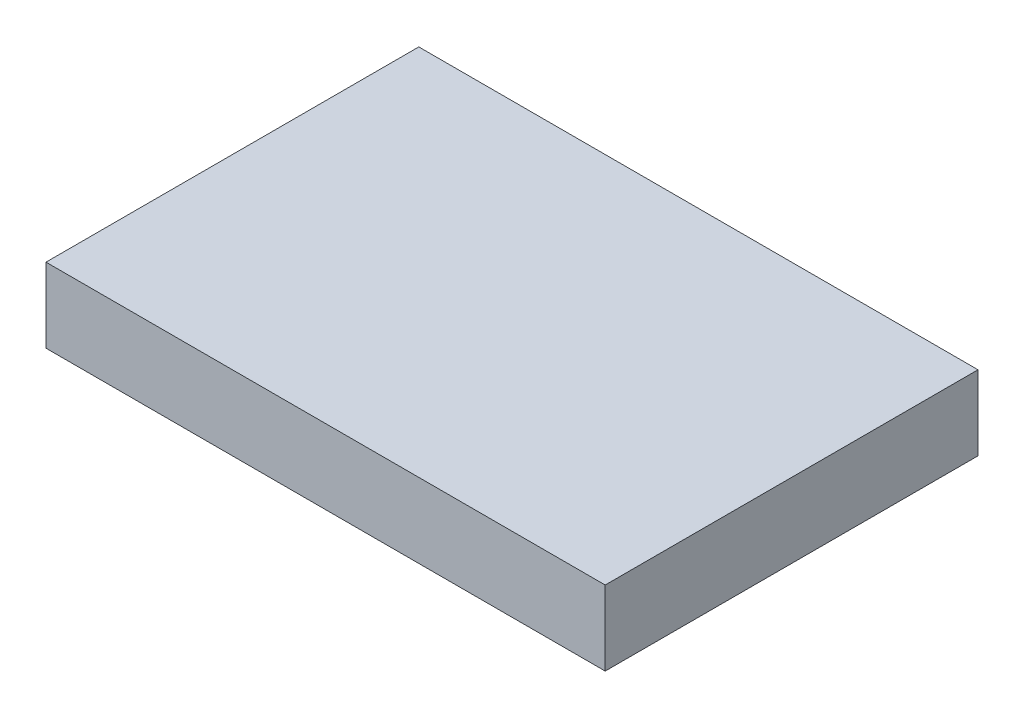
ISO-10303-21;
HEADER;
FILE_DESCRIPTION(('STEP AP214'),'2;1');
FILE_NAME('part.step','',(''),(''),'','','');
FILE_SCHEMA(('AUTOMOTIVE_DESIGN { 1 0 10303 214 1 1 1 1 }'));
ENDSEC;
DATA;
#1=APPLICATION_CONTEXT('core data for automotive mechanical design processes');
#2=APPLICATION_PROTOCOL_DEFINITION('international standard','automotive_design',2000,#1);
#3=PRODUCT_CONTEXT('',#1,'mechanical');
#4=PRODUCT('Part','Part','',(#3));
#5=PRODUCT_RELATED_PRODUCT_CATEGORY('part','',(#4));
#6=PRODUCT_DEFINITION_FORMATION('','',#4);
#7=PRODUCT_DEFINITION_CONTEXT('part definition',#1,'design');
#8=PRODUCT_DEFINITION('design','',#6,#7);
#9=PRODUCT_DEFINITION_SHAPE('','',#8);
#10=(LENGTH_UNIT() NAMED_UNIT(*) SI_UNIT(.MILLI.,.METRE.));
#11=(NAMED_UNIT(*) PLANE_ANGLE_UNIT() SI_UNIT($,.RADIAN.));
#12=(NAMED_UNIT(*) SI_UNIT($,.STERADIAN.) SOLID_ANGLE_UNIT());
#13=UNCERTAINTY_MEASURE_WITH_UNIT(LENGTH_MEASURE(1.E-05),#10,'distance_accuracy_value','');
#14=(GEOMETRIC_REPRESENTATION_CONTEXT(3) GLOBAL_UNCERTAINTY_ASSIGNED_CONTEXT((#13)) GLOBAL_UNIT_ASSIGNED_CONTEXT((#10,
#11,#12)) REPRESENTATION_CONTEXT('',''));
#15=CARTESIAN_POINT('',(0.,0.,0.));
#16=DIRECTION('',(0.,0.,1.));
#17=DIRECTION('',(1.,0.,0.));
#18=AXIS2_PLACEMENT_3D('',#15,#16,#17);
#19=CARTESIAN_POINT('',(45720.,12192.,30480.));
#20=DIRECTION('',(-1.,0.,0.));
#21=DIRECTION('',(0.,0.,1.));
#22=AXIS2_PLACEMENT_3D('',#19,#20,#21);
#23=PLANE('',#22);
#24=DIRECTION('',(0.,0.,-1.));
#25=VECTOR('',#24,1.);
#26=CARTESIAN_POINT('',(45720.,0.,30480.));
#27=LINE('',#26,#25);
#28=CARTESIAN_POINT('',(45720.,0.,30480.));
#29=VERTEX_POINT('',#28);
#30=CARTESIAN_POINT('',(45720.,0.,-30480.));
#31=VERTEX_POINT('',#30);
#32=EDGE_CURVE('E98',#29,#31,#27,.T.);
#33=ORIENTED_EDGE('',*,*,#32,.T.);
#34=DIRECTION('',(0.,-1.,0.));
#35=VECTOR('',#34,1.);
#36=CARTESIAN_POINT('',(45720.,12192.,-30480.));
#37=LINE('',#36,#35);
#38=CARTESIAN_POINT('',(45720.,12192.,-30480.));
#39=VERTEX_POINT('',#38);
#40=EDGE_CURVE('E11',#39,#31,#37,.T.);
#41=ORIENTED_EDGE('',*,*,#40,.F.);
#42=DIRECTION('',(0.,0.,-1.));
#43=VECTOR('',#42,1.);
#44=CARTESIAN_POINT('',(45720.,12192.,30480.));
#45=LINE('',#44,#43);
#46=CARTESIAN_POINT('',(45720.,12192.,30480.));
#47=VERTEX_POINT('',#46);
#48=EDGE_CURVE('E86',#47,#39,#45,.T.);
#49=ORIENTED_EDGE('',*,*,#48,.F.);
#50=DIRECTION('',(0.,-1.,0.));
#51=VECTOR('',#50,1.);
#52=CARTESIAN_POINT('',(45720.,12192.,30480.));
#53=LINE('',#52,#51);
#54=EDGE_CURVE('E94',#47,#29,#53,.T.);
#55=ORIENTED_EDGE('',*,*,#54,.T.);
#56=EDGE_LOOP('',(#33,#41,#49,#55));
#57=FACE_BOUND('',#56,.T.);
#58=ADVANCED_FACE('F35',(#57),#23,.F.);
#59=CARTESIAN_POINT('',(-45720.,12192.,-30480.));
#60=DIRECTION('',(0.,0.,1.));
#61=DIRECTION('',(1.,0.,0.));
#62=AXIS2_PLACEMENT_3D('',#59,#60,#61);
#63=PLANE('',#62);
#64=DIRECTION('',(-1.,0.,0.));
#65=VECTOR('',#64,1.);
#66=CARTESIAN_POINT('',(-45720.,0.,-30480.));
#67=LINE('',#66,#65);
#68=CARTESIAN_POINT('',(-45720.,0.,-30480.));
#69=VERTEX_POINT('',#68);
#70=EDGE_CURVE('E90',#31,#69,#67,.T.);
#71=ORIENTED_EDGE('',*,*,#70,.T.);
#72=DIRECTION('',(0.,-1.,0.));
#73=VECTOR('',#72,1.);
#74=CARTESIAN_POINT('',(-45720.,12192.,-30480.));
#75=LINE('',#74,#73);
#76=CARTESIAN_POINT('',(-45720.,12192.,-30480.));
#77=VERTEX_POINT('',#76);
#78=EDGE_CURVE('E43',#77,#69,#75,.T.);
#79=ORIENTED_EDGE('',*,*,#78,.F.);
#80=DIRECTION('',(-1.,0.,0.));
#81=VECTOR('',#80,1.);
#82=CARTESIAN_POINT('',(-45720.,12192.,-30480.));
#83=LINE('',#82,#81);
#84=EDGE_CURVE('E81',#39,#77,#83,.T.);
#85=ORIENTED_EDGE('',*,*,#84,.F.);
#86=ORIENTED_EDGE('',*,*,#40,.T.);
#87=EDGE_LOOP('',(#71,#79,#85,#86));
#88=FACE_BOUND('',#87,.T.);
#89=ADVANCED_FACE('F89',(#88),#63,.F.);
#90=CARTESIAN_POINT('',(-45720.,12192.,30480.));
#91=DIRECTION('',(1.,0.,0.));
#92=DIRECTION('',(0.,0.,-1.));
#93=AXIS2_PLACEMENT_3D('',#90,#91,#92);
#94=PLANE('',#93);
#95=DIRECTION('',(0.,0.,1.));
#96=VECTOR('',#95,1.);
#97=CARTESIAN_POINT('',(-45720.,0.,30480.));
#98=LINE('',#97,#96);
#99=CARTESIAN_POINT('',(-45720.,0.,30480.));
#100=VERTEX_POINT('',#99);
#101=EDGE_CURVE('E68',#69,#100,#98,.T.);
#102=ORIENTED_EDGE('',*,*,#101,.T.);
#103=DIRECTION('',(0.,-1.,0.));
#104=VECTOR('',#103,1.);
#105=CARTESIAN_POINT('',(-45720.,12192.,30480.));
#106=LINE('',#105,#104);
#107=CARTESIAN_POINT('',(-45720.,12192.,30480.));
#108=VERTEX_POINT('',#107);
#109=EDGE_CURVE('E91',#108,#100,#106,.T.);
#110=ORIENTED_EDGE('',*,*,#109,.F.);
#111=DIRECTION('',(0.,0.,1.));
#112=VECTOR('',#111,1.);
#113=CARTESIAN_POINT('',(-45720.,12192.,30480.));
#114=LINE('',#113,#112);
#115=EDGE_CURVE('E84',#77,#108,#114,.T.);
#116=ORIENTED_EDGE('',*,*,#115,.F.);
#117=ORIENTED_EDGE('',*,*,#78,.T.);
#118=EDGE_LOOP('',(#102,#110,#116,#117));
#119=FACE_BOUND('',#118,.T.);
#120=ADVANCED_FACE('F92',(#119),#94,.F.);
#121=CARTESIAN_POINT('',(-45720.,12192.,30480.));
#122=DIRECTION('',(0.,0.,-1.));
#123=DIRECTION('',(-1.,0.,0.));
#124=AXIS2_PLACEMENT_3D('',#121,#122,#123);
#125=PLANE('',#124);
#126=DIRECTION('',(1.,0.,0.));
#127=VECTOR('',#126,1.);
#128=CARTESIAN_POINT('',(-45720.,0.,30480.));
#129=LINE('',#128,#127);
#130=EDGE_CURVE('E74',#100,#29,#129,.T.);
#131=ORIENTED_EDGE('',*,*,#130,.T.);
#132=ORIENTED_EDGE('',*,*,#54,.F.);
#133=DIRECTION('',(1.,0.,0.));
#134=VECTOR('',#133,1.);
#135=CARTESIAN_POINT('',(-45720.,12192.,30480.));
#136=LINE('',#135,#134);
#137=EDGE_CURVE('E51',#108,#47,#136,.T.);
#138=ORIENTED_EDGE('',*,*,#137,.F.);
#139=ORIENTED_EDGE('',*,*,#109,.T.);
#140=EDGE_LOOP('',(#131,#132,#138,#139));
#141=FACE_BOUND('',#140,.T.);
#142=ADVANCED_FACE('F105',(#141),#125,.F.);
#143=CARTESIAN_POINT('',(0.,12192.,0.));
#144=DIRECTION('',(0.,-1.,0.));
#145=DIRECTION('',(0.,0.,-1.));
#146=AXIS2_PLACEMENT_3D('',#143,#144,#145);
#147=PLANE('',#146);
#148=ORIENTED_EDGE('',*,*,#48,.T.);
#149=ORIENTED_EDGE('',*,*,#84,.T.);
#150=ORIENTED_EDGE('',*,*,#115,.T.);
#151=ORIENTED_EDGE('',*,*,#137,.T.);
#152=EDGE_LOOP('',(#148,#149,#150,#151));
#153=FACE_BOUND('',#152,.T.);
#154=ADVANCED_FACE('F82',(#153),#147,.F.);
#155=CARTESIAN_POINT('',(0.,0.,0.));
#156=DIRECTION('',(0.,-1.,0.));
#157=DIRECTION('',(0.,0.,-1.));
#158=AXIS2_PLACEMENT_3D('',#155,#156,#157);
#159=PLANE('',#158);
#160=ORIENTED_EDGE('',*,*,#32,.F.);
#161=ORIENTED_EDGE('',*,*,#130,.F.);
#162=ORIENTED_EDGE('',*,*,#101,.F.);
#163=ORIENTED_EDGE('',*,*,#70,.F.);
#164=EDGE_LOOP('',(#160,#161,#162,#163));
#165=FACE_BOUND('',#164,.T.);
#166=ADVANCED_FACE('F108',(#165),#159,.T.);
#167=CLOSED_SHELL('',(#58,#89,#120,#142,#154,#166));
#168=MANIFOLD_SOLID_BREP('B2',#167);
#169=ADVANCED_BREP_SHAPE_REPRESENTATION('',(#18,#168),#14);
#170=SHAPE_DEFINITION_REPRESENTATION(#9,#169);
ENDSEC;
END-ISO-10303-21;
